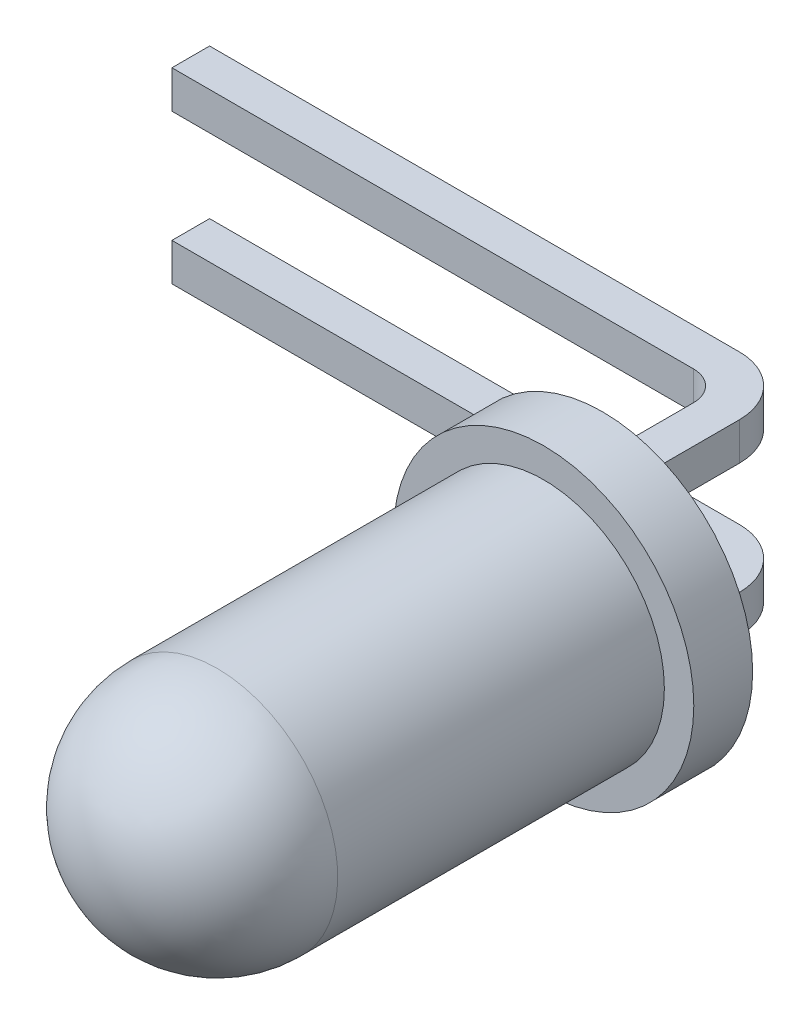
ISO-10303-21;
HEADER;
FILE_DESCRIPTION(('STEP AP214'),'2;1');
FILE_NAME('part.step','',(''),(''),'','','');
FILE_SCHEMA(('AUTOMOTIVE_DESIGN { 1 0 10303 214 1 1 1 1 }'));
ENDSEC;
DATA;
#1=APPLICATION_CONTEXT('core data for automotive mechanical design processes');
#2=APPLICATION_PROTOCOL_DEFINITION('international standard','automotive_design',2000,#1);
#3=PRODUCT_CONTEXT('',#1,'mechanical');
#4=PRODUCT('Part','Part','',(#3));
#5=PRODUCT_RELATED_PRODUCT_CATEGORY('part','',(#4));
#6=PRODUCT_DEFINITION_FORMATION('','',#4);
#7=PRODUCT_DEFINITION_CONTEXT('part definition',#1,'design');
#8=PRODUCT_DEFINITION('design','',#6,#7);
#9=PRODUCT_DEFINITION_SHAPE('','',#8);
#10=(LENGTH_UNIT() NAMED_UNIT(*) SI_UNIT(.MILLI.,.METRE.));
#11=(NAMED_UNIT(*) PLANE_ANGLE_UNIT() SI_UNIT($,.RADIAN.));
#12=(NAMED_UNIT(*) SI_UNIT($,.STERADIAN.) SOLID_ANGLE_UNIT());
#13=UNCERTAINTY_MEASURE_WITH_UNIT(LENGTH_MEASURE(1.E-05),#10,'distance_accuracy_value','');
#14=(GEOMETRIC_REPRESENTATION_CONTEXT(3) GLOBAL_UNCERTAINTY_ASSIGNED_CONTEXT((#13)) GLOBAL_UNIT_ASSIGNED_CONTEXT((#10,
#11,#12)) REPRESENTATION_CONTEXT('',''));
#15=CARTESIAN_POINT('',(0.,0.,0.));
#16=DIRECTION('',(0.,0.,1.));
#17=DIRECTION('',(1.,0.,0.));
#18=AXIS2_PLACEMENT_3D('',#15,#16,#17);
#19=CARTESIAN_POINT('',(0.,0.,0.));
#20=DIRECTION('',(0.,0.,-1.));
#21=DIRECTION('',(-1.,0.,0.));
#22=AXIS2_PLACEMENT_3D('',#19,#20,#21);
#23=PLANE('',#22);
#24=CARTESIAN_POINT('',(0.,0.,0.));
#25=DIRECTION('',(0.,0.,-1.));
#26=DIRECTION('',(-1.,0.,0.));
#27=AXIS2_PLACEMENT_3D('',#24,#25,#26);
#28=CIRCLE('',#27,2.55);
#29=CARTESIAN_POINT('',(-2.55,0.,0.));
#30=VERTEX_POINT('',#29);
#31=EDGE_CURVE('E256',#30,#30,#28,.T.);
#32=ORIENTED_EDGE('',*,*,#31,.T.);
#33=EDGE_LOOP('',(#32));
#34=FACE_BOUND('',#33,.T.);
#35=DIRECTION('',(1.,0.,0.));
#36=VECTOR('',#35,1.);
#37=CARTESIAN_POINT('',(-0.32,0.95,0.));
#38=LINE('',#37,#36);
#39=CARTESIAN_POINT('',(-0.32,0.95,0.));
#40=VERTEX_POINT('',#39);
#41=CARTESIAN_POINT('',(0.32,0.95,0.));
#42=VERTEX_POINT('',#41);
#43=EDGE_CURVE('E230',#40,#42,#38,.T.);
#44=ORIENTED_EDGE('',*,*,#43,.T.);
#45=DIRECTION('',(0.,-1.,0.));
#46=VECTOR('',#45,1.);
#47=CARTESIAN_POINT('',(0.32,1.59,0.));
#48=LINE('',#47,#46);
#49=CARTESIAN_POINT('',(0.32,1.59,0.));
#50=VERTEX_POINT('',#49);
#51=EDGE_CURVE('E227',#50,#42,#48,.T.);
#52=ORIENTED_EDGE('',*,*,#51,.F.);
#53=DIRECTION('',(-1.,0.,0.));
#54=VECTOR('',#53,1.);
#55=CARTESIAN_POINT('',(0.32,1.59,0.));
#56=LINE('',#55,#54);
#57=CARTESIAN_POINT('',(-0.32,1.59,0.));
#58=VERTEX_POINT('',#57);
#59=EDGE_CURVE('E236',#50,#58,#56,.T.);
#60=ORIENTED_EDGE('',*,*,#59,.T.);
#61=DIRECTION('',(0.,1.,0.));
#62=VECTOR('',#61,1.);
#63=CARTESIAN_POINT('',(-0.32,0.95,0.));
#64=LINE('',#63,#62);
#65=EDGE_CURVE('E233',#40,#58,#64,.T.);
#66=ORIENTED_EDGE('',*,*,#65,.F.);
#67=EDGE_LOOP('',(#44,#52,#60,#66));
#68=FACE_BOUND('',#67,.T.);
#69=DIRECTION('',(1.,0.,0.));
#70=VECTOR('',#69,1.);
#71=CARTESIAN_POINT('',(-0.32,-1.59,0.));
#72=LINE('',#71,#70);
#73=CARTESIAN_POINT('',(-0.32,-1.59,0.));
#74=VERTEX_POINT('',#73);
#75=CARTESIAN_POINT('',(0.320000000000001,-1.59,0.));
#76=VERTEX_POINT('',#75);
#77=EDGE_CURVE('E210',#74,#76,#72,.T.);
#78=ORIENTED_EDGE('',*,*,#77,.T.);
#79=DIRECTION('',(0.,-1.,0.));
#80=VECTOR('',#79,1.);
#81=CARTESIAN_POINT('',(0.320000000000001,-0.95,0.));
#82=LINE('',#81,#80);
#83=CARTESIAN_POINT('',(0.320000000000001,-0.95,0.));
#84=VERTEX_POINT('',#83);
#85=EDGE_CURVE('E201',#84,#76,#82,.T.);
#86=ORIENTED_EDGE('',*,*,#85,.F.);
#87=DIRECTION('',(-1.,0.,0.));
#88=VECTOR('',#87,1.);
#89=CARTESIAN_POINT('',(0.320000000000001,-0.95,0.));
#90=LINE('',#89,#88);
#91=CARTESIAN_POINT('',(-0.32,-0.95,0.));
#92=VERTEX_POINT('',#91);
#93=EDGE_CURVE('E216',#84,#92,#90,.T.);
#94=ORIENTED_EDGE('',*,*,#93,.T.);
#95=DIRECTION('',(0.,1.,0.));
#96=VECTOR('',#95,1.);
#97=CARTESIAN_POINT('',(-0.32,-1.59,0.));
#98=LINE('',#97,#96);
#99=EDGE_CURVE('E213',#74,#92,#98,.T.);
#100=ORIENTED_EDGE('',*,*,#99,.F.);
#101=EDGE_LOOP('',(#78,#86,#94,#100));
#102=FACE_BOUND('',#101,.T.);
#103=ADVANCED_FACE('F37',(#34,#68,#102),#23,.T.);
#104=CARTESIAN_POINT('',(0.,0.,0.));
#105=DIRECTION('',(0.,0.,-1.));
#106=DIRECTION('',(-1.,0.,0.));
#107=AXIS2_PLACEMENT_3D('',#104,#105,#106);
#108=CYLINDRICAL_SURFACE('',#107,2.55);
#109=CARTESIAN_POINT('',(0.,0.,1.));
#110=DIRECTION('',(0.,0.,-1.));
#111=DIRECTION('',(-1.,0.,0.));
#112=AXIS2_PLACEMENT_3D('',#109,#110,#111);
#113=CIRCLE('',#112,2.55);
#114=CARTESIAN_POINT('',(-2.55,0.,1.));
#115=VERTEX_POINT('',#114);
#116=EDGE_CURVE('E253',#115,#115,#113,.T.);
#117=ORIENTED_EDGE('',*,*,#116,.T.);
#118=EDGE_LOOP('',(#117));
#119=FACE_BOUND('',#118,.T.);
#120=ORIENTED_EDGE('',*,*,#31,.F.);
#121=EDGE_LOOP('',(#120));
#122=FACE_BOUND('',#121,.T.);
#123=ADVANCED_FACE('F323',(#119,#122),#108,.T.);
#124=CARTESIAN_POINT('',(0.,2.55,1.));
#125=DIRECTION('',(0.,0.,1.));
#126=DIRECTION('',(1.,0.,0.));
#127=AXIS2_PLACEMENT_3D('',#124,#125,#126);
#128=PLANE('',#127);
#129=CARTESIAN_POINT('',(0.,0.,1.));
#130=DIRECTION('',(0.,0.,-1.));
#131=DIRECTION('',(-1.,0.,0.));
#132=AXIS2_PLACEMENT_3D('',#129,#130,#131);
#133=CIRCLE('',#132,2.05);
#134=CARTESIAN_POINT('',(-2.05,0.,1.));
#135=VERTEX_POINT('',#134);
#136=EDGE_CURVE('E250',#135,#135,#133,.T.);
#137=ORIENTED_EDGE('',*,*,#136,.T.);
#138=EDGE_LOOP('',(#137));
#139=FACE_BOUND('',#138,.T.);
#140=ORIENTED_EDGE('',*,*,#116,.F.);
#141=EDGE_LOOP('',(#140));
#142=FACE_BOUND('',#141,.T.);
#143=ADVANCED_FACE('F329',(#139,#142),#128,.T.);
#144=CARTESIAN_POINT('',(0.,0.,0.));
#145=DIRECTION('',(0.,0.,-1.));
#146=DIRECTION('',(-1.,0.,0.));
#147=AXIS2_PLACEMENT_3D('',#144,#145,#146);
#148=CYLINDRICAL_SURFACE('',#147,2.05);
#149=CARTESIAN_POINT('',(0.,0.,6.55));
#150=DIRECTION('',(0.,0.,-1.));
#151=DIRECTION('',(-1.,0.,0.));
#152=AXIS2_PLACEMENT_3D('',#149,#150,#151);
#153=CIRCLE('',#152,2.05);
#154=CARTESIAN_POINT('',(-2.05,0.,6.55));
#155=VERTEX_POINT('',#154);
#156=EDGE_CURVE('E247',#155,#155,#153,.T.);
#157=ORIENTED_EDGE('',*,*,#156,.T.);
#158=EDGE_LOOP('',(#157));
#159=FACE_BOUND('',#158,.T.);
#160=ORIENTED_EDGE('',*,*,#136,.F.);
#161=EDGE_LOOP('',(#160));
#162=FACE_BOUND('',#161,.T.);
#163=ADVANCED_FACE('F400',(#159,#162),#148,.T.);
#164=CARTESIAN_POINT('',(0.,0.,6.55));
#165=DIRECTION('',(0.,0.,-1.));
#166=DIRECTION('',(0.,1.,0.));
#167=AXIS2_PLACEMENT_3D('',#164,#165,#166);
#168=SPHERICAL_SURFACE('',#167,2.05);
#169=ORIENTED_EDGE('',*,*,#156,.F.);
#170=EDGE_LOOP('',(#169));
#171=FACE_BOUND('',#170,.T.);
#172=ADVANCED_FACE('F397',(#171),#168,.T.);
#173=CARTESIAN_POINT('',(0.32,1.59,-2.683));
#174=DIRECTION('',(-1.,0.,0.));
#175=DIRECTION('',(0.,-1.,0.));
#176=AXIS2_PLACEMENT_3D('',#173,#174,#175);
#177=PLANE('',#176);
#178=DIRECTION('',(0.,0.,1.));
#179=VECTOR('',#178,1.);
#180=CARTESIAN_POINT('',(0.32,0.95,-2.683));
#181=LINE('',#180,#179);
#182=CARTESIAN_POINT('',(0.32,0.95,-2.00299999999999));
#183=VERTEX_POINT('',#182);
#184=EDGE_CURVE('E245',#183,#42,#181,.T.);
#185=ORIENTED_EDGE('',*,*,#184,.F.);
#186=DIRECTION('',(0.,1.,0.));
#187=VECTOR('',#186,1.);
#188=CARTESIAN_POINT('',(0.32,1.59,-2.00299999999999));
#189=LINE('',#188,#187);
#190=CARTESIAN_POINT('',(0.32,1.59,-2.00299999999999));
#191=VERTEX_POINT('',#190);
#192=EDGE_CURVE('E268',#183,#191,#189,.T.);
#193=ORIENTED_EDGE('',*,*,#192,.T.);
#194=DIRECTION('',(0.,0.,1.));
#195=VECTOR('',#194,1.);
#196=CARTESIAN_POINT('',(0.32,1.59,-2.683));
#197=LINE('',#196,#195);
#198=EDGE_CURVE('E239',#191,#50,#197,.T.);
#199=ORIENTED_EDGE('',*,*,#198,.T.);
#200=ORIENTED_EDGE('',*,*,#51,.T.);
#201=EDGE_LOOP('',(#185,#193,#199,#200));
#202=FACE_BOUND('',#201,.T.);
#203=ADVANCED_FACE('F306',(#202),#177,.F.);
#204=CARTESIAN_POINT('',(-0.32,0.95,-2.683));
#205=DIRECTION('',(0.,-1.,0.));
#206=DIRECTION('',(1.,0.,0.));
#207=AXIS2_PLACEMENT_3D('',#204,#205,#206);
#208=PLANE('',#207);
#209=DIRECTION('',(1.,0.,0.));
#210=VECTOR('',#209,1.);
#211=CARTESIAN_POINT('',(-9.68,0.949999999999997,-3.00299999999999));
#212=LINE('',#211,#210);
#213=CARTESIAN_POINT('',(-9.68,0.949999999999997,-3.00299999999999));
#214=VERTEX_POINT('',#213);
#215=CARTESIAN_POINT('',(-0.68,0.949999999999999,-3.00299999999999));
#216=VERTEX_POINT('',#215);
#217=EDGE_CURVE('E182',#214,#216,#212,.T.);
#218=ORIENTED_EDGE('',*,*,#217,.T.);
#219=CARTESIAN_POINT('',(-0.68,0.95,-2.00299999999999));
#220=DIRECTION('',(0.,-1.,0.));
#221=DIRECTION('',(1.,0.,0.));
#222=AXIS2_PLACEMENT_3D('',#219,#220,#221);
#223=CIRCLE('',#222,1.);
#224=EDGE_CURVE('E275',#216,#183,#223,.T.);
#225=ORIENTED_EDGE('',*,*,#224,.T.);
#226=ORIENTED_EDGE('',*,*,#184,.T.);
#227=ORIENTED_EDGE('',*,*,#43,.F.);
#228=DIRECTION('',(0.,0.,1.));
#229=VECTOR('',#228,1.);
#230=CARTESIAN_POINT('',(-0.32,0.95,-2.683));
#231=LINE('',#230,#229);
#232=CARTESIAN_POINT('',(-0.32,0.95,-1.86299999999999));
#233=VERTEX_POINT('',#232);
#234=EDGE_CURVE('E243',#233,#40,#231,.T.);
#235=ORIENTED_EDGE('',*,*,#234,.F.);
#236=CARTESIAN_POINT('',(-0.82,0.95,-1.86299999999999));
#237=DIRECTION('',(0.,-1.,0.));
#238=DIRECTION('',(1.,0.,0.));
#239=AXIS2_PLACEMENT_3D('',#236,#237,#238);
#240=CIRCLE('',#239,0.5);
#241=CARTESIAN_POINT('',(-0.82,0.949999999999999,-2.36299999999999));
#242=VERTEX_POINT('',#241);
#243=EDGE_CURVE('E45',#233,#242,#240,.F.);
#244=ORIENTED_EDGE('',*,*,#243,.T.);
#245=DIRECTION('',(1.,0.,0.));
#246=VECTOR('',#245,1.);
#247=CARTESIAN_POINT('',(-9.68,0.949999999999997,-2.36299999999999));
#248=LINE('',#247,#246);
#249=CARTESIAN_POINT('',(-9.68,0.949999999999997,-2.36299999999999));
#250=VERTEX_POINT('',#249);
#251=EDGE_CURVE('E159',#250,#242,#248,.T.);
#252=ORIENTED_EDGE('',*,*,#251,.F.);
#253=DIRECTION('',(0.,0.,-1.));
#254=VECTOR('',#253,1.);
#255=CARTESIAN_POINT('',(-9.68,0.949999999999997,-2.36299999999999));
#256=LINE('',#255,#254);
#257=EDGE_CURVE('E170',#250,#214,#256,.T.);
#258=ORIENTED_EDGE('',*,*,#257,.T.);
#259=EDGE_LOOP('',(#218,#225,#226,#227,#235,#244,#252,#258));
#260=FACE_BOUND('',#259,.T.);
#261=ADVANCED_FACE('F289',(#260),#208,.T.);
#262=CARTESIAN_POINT('',(-0.32,0.95,-2.683));
#263=DIRECTION('',(1.,0.,0.));
#264=DIRECTION('',(0.,1.,0.));
#265=AXIS2_PLACEMENT_3D('',#262,#263,#264);
#266=PLANE('',#265);
#267=DIRECTION('',(0.,0.,1.));
#268=VECTOR('',#267,1.);
#269=CARTESIAN_POINT('',(-0.32,1.59,-2.683));
#270=LINE('',#269,#268);
#271=CARTESIAN_POINT('',(-0.32,1.59,-1.86299999999999));
#272=VERTEX_POINT('',#271);
#273=EDGE_CURVE('E241',#272,#58,#270,.T.);
#274=ORIENTED_EDGE('',*,*,#273,.F.);
#275=DIRECTION('',(0.,-1.,0.));
#276=VECTOR('',#275,1.);
#277=CARTESIAN_POINT('',(-0.32,0.95,-1.86299999999999));
#278=LINE('',#277,#276);
#279=EDGE_CURVE('E264',#272,#233,#278,.T.);
#280=ORIENTED_EDGE('',*,*,#279,.T.);
#281=ORIENTED_EDGE('',*,*,#234,.T.);
#282=ORIENTED_EDGE('',*,*,#65,.T.);
#283=EDGE_LOOP('',(#274,#280,#281,#282));
#284=FACE_BOUND('',#283,.T.);
#285=ADVANCED_FACE('F297',(#284),#266,.F.);
#286=CARTESIAN_POINT('',(0.32,1.59,-2.683));
#287=DIRECTION('',(0.,1.,0.));
#288=DIRECTION('',(0.,0.,1.));
#289=AXIS2_PLACEMENT_3D('',#286,#287,#288);
#290=PLANE('',#289);
#291=ORIENTED_EDGE('',*,*,#198,.F.);
#292=CARTESIAN_POINT('',(-0.68,1.59,-2.00299999999999));
#293=DIRECTION('',(0.,1.,0.));
#294=DIRECTION('',(0.,0.,1.));
#295=AXIS2_PLACEMENT_3D('',#292,#293,#294);
#296=CIRCLE('',#295,1.);
#297=CARTESIAN_POINT('',(-0.68,1.59,-3.00299999999999));
#298=VERTEX_POINT('',#297);
#299=EDGE_CURVE('E271',#191,#298,#296,.T.);
#300=ORIENTED_EDGE('',*,*,#299,.T.);
#301=DIRECTION('',(1.,0.,0.));
#302=VECTOR('',#301,1.);
#303=CARTESIAN_POINT('',(-9.68,1.59,-3.00299999999999));
#304=LINE('',#303,#302);
#305=CARTESIAN_POINT('',(-9.68,1.59,-3.00299999999999));
#306=VERTEX_POINT('',#305);
#307=EDGE_CURVE('E175',#306,#298,#304,.T.);
#308=ORIENTED_EDGE('',*,*,#307,.F.);
#309=DIRECTION('',(0.,0.,1.));
#310=VECTOR('',#309,1.);
#311=CARTESIAN_POINT('',(-9.68,1.59,-2.36299999999999));
#312=LINE('',#311,#310);
#313=CARTESIAN_POINT('',(-9.68,1.59,-2.36299999999999));
#314=VERTEX_POINT('',#313);
#315=EDGE_CURVE('E167',#306,#314,#312,.T.);
#316=ORIENTED_EDGE('',*,*,#315,.T.);
#317=DIRECTION('',(1.,0.,0.));
#318=VECTOR('',#317,1.);
#319=CARTESIAN_POINT('',(-9.68,1.59,-2.36299999999999));
#320=LINE('',#319,#318);
#321=CARTESIAN_POINT('',(-0.82,1.59,-2.36299999999999));
#322=VERTEX_POINT('',#321);
#323=EDGE_CURVE('E149',#314,#322,#320,.T.);
#324=ORIENTED_EDGE('',*,*,#323,.T.);
#325=CARTESIAN_POINT('',(-0.82,1.59,-1.86299999999999));
#326=DIRECTION('',(0.,1.,0.));
#327=DIRECTION('',(0.,0.,1.));
#328=AXIS2_PLACEMENT_3D('',#325,#326,#327);
#329=CIRCLE('',#328,0.5);
#330=EDGE_CURVE('E12',#322,#272,#329,.F.);
#331=ORIENTED_EDGE('',*,*,#330,.T.);
#332=ORIENTED_EDGE('',*,*,#273,.T.);
#333=ORIENTED_EDGE('',*,*,#59,.F.);
#334=EDGE_LOOP('',(#291,#300,#308,#316,#324,#331,#332,#333));
#335=FACE_BOUND('',#334,.T.);
#336=ADVANCED_FACE('F173',(#335),#290,.T.);
#337=CARTESIAN_POINT('',(0.320000000000001,-0.95,-2.683));
#338=DIRECTION('',(-1.,0.,0.));
#339=DIRECTION('',(0.,-1.,0.));
#340=AXIS2_PLACEMENT_3D('',#337,#338,#339);
#341=PLANE('',#340);
#342=DIRECTION('',(0.,0.,1.));
#343=VECTOR('',#342,1.);
#344=CARTESIAN_POINT('',(0.320000000000001,-1.59,-2.683));
#345=LINE('',#344,#343);
#346=CARTESIAN_POINT('',(0.320000000000001,-1.59,-2.003));
#347=VERTEX_POINT('',#346);
#348=EDGE_CURVE('E225',#347,#76,#345,.T.);
#349=ORIENTED_EDGE('',*,*,#348,.F.);
#350=DIRECTION('',(0.,1.,0.));
#351=VECTOR('',#350,1.);
#352=CARTESIAN_POINT('',(0.320000000000001,-0.95,-2.003));
#353=LINE('',#352,#351);
#354=CARTESIAN_POINT('',(0.320000000000001,-0.95,-2.003));
#355=VERTEX_POINT('',#354);
#356=EDGE_CURVE('E277',#347,#355,#353,.T.);
#357=ORIENTED_EDGE('',*,*,#356,.T.);
#358=DIRECTION('',(0.,0.,1.));
#359=VECTOR('',#358,1.);
#360=CARTESIAN_POINT('',(0.320000000000001,-0.95,-2.683));
#361=LINE('',#360,#359);
#362=EDGE_CURVE('E219',#355,#84,#361,.T.);
#363=ORIENTED_EDGE('',*,*,#362,.T.);
#364=ORIENTED_EDGE('',*,*,#85,.T.);
#365=EDGE_LOOP('',(#349,#357,#363,#364));
#366=FACE_BOUND('',#365,.T.);
#367=ADVANCED_FACE('F352',(#366),#341,.F.);
#368=CARTESIAN_POINT('',(-0.32,-1.59,-2.683));
#369=DIRECTION('',(0.,-1.,0.));
#370=DIRECTION('',(1.,0.,0.));
#371=AXIS2_PLACEMENT_3D('',#368,#369,#370);
#372=PLANE('',#371);
#373=DIRECTION('',(1.,0.,0.));
#374=VECTOR('',#373,1.);
#375=CARTESIAN_POINT('',(-9.68,-1.59,-3.003));
#376=LINE('',#375,#374);
#377=CARTESIAN_POINT('',(-9.68,-1.59,-3.003));
#378=VERTEX_POINT('',#377);
#379=CARTESIAN_POINT('',(-0.679999999999998,-1.59,-3.003));
#380=VERTEX_POINT('',#379);
#381=EDGE_CURVE('E204',#378,#380,#376,.T.);
#382=ORIENTED_EDGE('',*,*,#381,.T.);
#383=CARTESIAN_POINT('',(-0.679999999999999,-1.59,-2.003));
#384=DIRECTION('',(0.,-1.,0.));
#385=DIRECTION('',(1.,0.,0.));
#386=AXIS2_PLACEMENT_3D('',#383,#384,#385);
#387=CIRCLE('',#386,1.);
#388=EDGE_CURVE('E282',#380,#347,#387,.T.);
#389=ORIENTED_EDGE('',*,*,#388,.T.);
#390=ORIENTED_EDGE('',*,*,#348,.T.);
#391=ORIENTED_EDGE('',*,*,#77,.F.);
#392=DIRECTION('',(0.,0.,1.));
#393=VECTOR('',#392,1.);
#394=CARTESIAN_POINT('',(-0.32,-1.59,-2.683));
#395=LINE('',#394,#393);
#396=CARTESIAN_POINT('',(-0.32,-1.59,-1.863));
#397=VERTEX_POINT('',#396);
#398=EDGE_CURVE('E223',#397,#74,#395,.T.);
#399=ORIENTED_EDGE('',*,*,#398,.F.);
#400=CARTESIAN_POINT('',(-0.82,-1.59,-1.863));
#401=DIRECTION('',(0.,-1.,0.));
#402=DIRECTION('',(1.,0.,0.));
#403=AXIS2_PLACEMENT_3D('',#400,#401,#402);
#404=CIRCLE('',#403,0.5);
#405=CARTESIAN_POINT('',(-0.82,-1.59,-2.363));
#406=VERTEX_POINT('',#405);
#407=EDGE_CURVE('E284',#397,#406,#404,.F.);
#408=ORIENTED_EDGE('',*,*,#407,.T.);
#409=DIRECTION('',(1.,0.,0.));
#410=VECTOR('',#409,1.);
#411=CARTESIAN_POINT('',(-9.68,-1.59,-2.363));
#412=LINE('',#411,#410);
#413=CARTESIAN_POINT('',(-9.68,-1.59,-2.363));
#414=VERTEX_POINT('',#413);
#415=EDGE_CURVE('E197',#414,#406,#412,.T.);
#416=ORIENTED_EDGE('',*,*,#415,.F.);
#417=DIRECTION('',(0.,0.,-1.));
#418=VECTOR('',#417,1.);
#419=CARTESIAN_POINT('',(-9.68,-1.59,-2.363));
#420=LINE('',#419,#418);
#421=EDGE_CURVE('E188',#414,#378,#420,.T.);
#422=ORIENTED_EDGE('',*,*,#421,.T.);
#423=EDGE_LOOP('',(#382,#389,#390,#391,#399,#408,#416,#422));
#424=FACE_BOUND('',#423,.T.);
#425=ADVANCED_FACE('F349',(#424),#372,.T.);
#426=CARTESIAN_POINT('',(-0.32,-1.59,-2.683));
#427=DIRECTION('',(1.,0.,0.));
#428=DIRECTION('',(0.,0.,-1.));
#429=AXIS2_PLACEMENT_3D('',#426,#427,#428);
#430=PLANE('',#429);
#431=DIRECTION('',(0.,0.,1.));
#432=VECTOR('',#431,1.);
#433=CARTESIAN_POINT('',(-0.32,-0.95,-2.683));
#434=LINE('',#433,#432);
#435=CARTESIAN_POINT('',(-0.32,-0.95,-1.863));
#436=VERTEX_POINT('',#435);
#437=EDGE_CURVE('E221',#436,#92,#434,.T.);
#438=ORIENTED_EDGE('',*,*,#437,.F.);
#439=DIRECTION('',(0.,-1.,0.));
#440=VECTOR('',#439,1.);
#441=CARTESIAN_POINT('',(-0.32,-1.59,-1.863));
#442=LINE('',#441,#440);
#443=EDGE_CURVE('E259',#436,#397,#442,.T.);
#444=ORIENTED_EDGE('',*,*,#443,.T.);
#445=ORIENTED_EDGE('',*,*,#398,.T.);
#446=ORIENTED_EDGE('',*,*,#99,.T.);
#447=EDGE_LOOP('',(#438,#444,#445,#446));
#448=FACE_BOUND('',#447,.T.);
#449=ADVANCED_FACE('F361',(#448),#430,.F.);
#450=CARTESIAN_POINT('',(0.320000000000001,-0.95,-2.683));
#451=DIRECTION('',(0.,1.,0.));
#452=DIRECTION('',(-1.,0.,0.));
#453=AXIS2_PLACEMENT_3D('',#450,#451,#452);
#454=PLANE('',#453);
#455=ORIENTED_EDGE('',*,*,#362,.F.);
#456=CARTESIAN_POINT('',(-0.679999999999999,-0.95,-2.003));
#457=DIRECTION('',(0.,1.,0.));
#458=DIRECTION('',(-1.,0.,0.));
#459=AXIS2_PLACEMENT_3D('',#456,#457,#458);
#460=CIRCLE('',#459,1.);
#461=CARTESIAN_POINT('',(-0.68,-0.95,-3.003));
#462=VERTEX_POINT('',#461);
#463=EDGE_CURVE('E60',#355,#462,#460,.T.);
#464=ORIENTED_EDGE('',*,*,#463,.T.);
#465=DIRECTION('',(1.,0.,0.));
#466=VECTOR('',#465,1.);
#467=CARTESIAN_POINT('',(-9.68,-0.950000000000002,-3.003));
#468=LINE('',#467,#466);
#469=CARTESIAN_POINT('',(-9.68,-0.950000000000002,-3.003));
#470=VERTEX_POINT('',#469);
#471=EDGE_CURVE('E202',#470,#462,#468,.T.);
#472=ORIENTED_EDGE('',*,*,#471,.F.);
#473=DIRECTION('',(0.,0.,1.));
#474=VECTOR('',#473,1.);
#475=CARTESIAN_POINT('',(-9.68,-0.950000000000003,-2.363));
#476=LINE('',#475,#474);
#477=CARTESIAN_POINT('',(-9.68,-0.950000000000003,-2.363));
#478=VERTEX_POINT('',#477);
#479=EDGE_CURVE('E194',#470,#478,#476,.T.);
#480=ORIENTED_EDGE('',*,*,#479,.T.);
#481=DIRECTION('',(1.,0.,0.));
#482=VECTOR('',#481,1.);
#483=CARTESIAN_POINT('',(-9.68,-0.950000000000003,-2.363));
#484=LINE('',#483,#482);
#485=CARTESIAN_POINT('',(-0.82,-0.95,-2.363));
#486=VERTEX_POINT('',#485);
#487=EDGE_CURVE('E198',#478,#486,#484,.T.);
#488=ORIENTED_EDGE('',*,*,#487,.T.);
#489=CARTESIAN_POINT('',(-0.82,-0.95,-1.863));
#490=DIRECTION('',(0.,1.,0.));
#491=DIRECTION('',(-1.,0.,0.));
#492=AXIS2_PLACEMENT_3D('',#489,#490,#491);
#493=CIRCLE('',#492,0.5);
#494=EDGE_CURVE('E286',#486,#436,#493,.F.);
#495=ORIENTED_EDGE('',*,*,#494,.T.);
#496=ORIENTED_EDGE('',*,*,#437,.T.);
#497=ORIENTED_EDGE('',*,*,#93,.F.);
#498=EDGE_LOOP('',(#455,#464,#472,#480,#488,#495,#496,#497));
#499=FACE_BOUND('',#498,.T.);
#500=ADVANCED_FACE('F356',(#499),#454,.T.);
#501=CARTESIAN_POINT('',(-9.68,-0.950000000000003,-2.363));
#502=DIRECTION('',(0.,0.,1.));
#503=DIRECTION('',(1.,0.,0.));
#504=AXIS2_PLACEMENT_3D('',#501,#502,#503);
#505=PLANE('',#504);
#506=ORIENTED_EDGE('',*,*,#415,.T.);
#507=DIRECTION('',(0.,-1.,0.));
#508=VECTOR('',#507,1.);
#509=CARTESIAN_POINT('',(-0.82,-0.950000000000003,-2.363));
#510=LINE('',#509,#508);
#511=EDGE_CURVE('E262',#406,#486,#510,.F.);
#512=ORIENTED_EDGE('',*,*,#511,.T.);
#513=ORIENTED_EDGE('',*,*,#487,.F.);
#514=DIRECTION('',(0.,-1.,0.));
#515=VECTOR('',#514,1.);
#516=CARTESIAN_POINT('',(-9.68,-0.950000000000003,-2.363));
#517=LINE('',#516,#515);
#518=EDGE_CURVE('E181',#478,#414,#517,.T.);
#519=ORIENTED_EDGE('',*,*,#518,.T.);
#520=EDGE_LOOP('',(#506,#512,#513,#519));
#521=FACE_BOUND('',#520,.T.);
#522=ADVANCED_FACE('F366',(#521),#505,.T.);
#523=CARTESIAN_POINT('',(-9.68,-0.950000000000002,-3.003));
#524=DIRECTION('',(0.,0.,-1.));
#525=DIRECTION('',(-1.,0.,0.));
#526=AXIS2_PLACEMENT_3D('',#523,#524,#525);
#527=PLANE('',#526);
#528=ORIENTED_EDGE('',*,*,#471,.T.);
#529=DIRECTION('',(0.,1.,0.));
#530=VECTOR('',#529,1.);
#531=CARTESIAN_POINT('',(-0.679999999999999,-1.59,-3.003));
#532=LINE('',#531,#530);
#533=EDGE_CURVE('E52',#462,#380,#532,.F.);
#534=ORIENTED_EDGE('',*,*,#533,.T.);
#535=ORIENTED_EDGE('',*,*,#381,.F.);
#536=DIRECTION('',(0.,1.,0.));
#537=VECTOR('',#536,1.);
#538=CARTESIAN_POINT('',(-9.68,-0.950000000000002,-3.003));
#539=LINE('',#538,#537);
#540=EDGE_CURVE('E191',#378,#470,#539,.T.);
#541=ORIENTED_EDGE('',*,*,#540,.T.);
#542=EDGE_LOOP('',(#528,#534,#535,#541));
#543=FACE_BOUND('',#542,.T.);
#544=ADVANCED_FACE('F371',(#543),#527,.T.);
#545=CARTESIAN_POINT('',(-9.68,0.,0.));
#546=DIRECTION('',(1.,0.,0.));
#547=DIRECTION('',(0.,1.,0.));
#548=AXIS2_PLACEMENT_3D('',#545,#546,#547);
#549=PLANE('',#548);
#550=ORIENTED_EDGE('',*,*,#518,.F.);
#551=ORIENTED_EDGE('',*,*,#479,.F.);
#552=ORIENTED_EDGE('',*,*,#540,.F.);
#553=ORIENTED_EDGE('',*,*,#421,.F.);
#554=EDGE_LOOP('',(#550,#551,#552,#553));
#555=FACE_BOUND('',#554,.T.);
#556=ADVANCED_FACE('F320',(#555),#549,.F.);
#557=CARTESIAN_POINT('',(-9.68,1.59,-2.36299999999999));
#558=DIRECTION('',(0.,0.,1.));
#559=DIRECTION('',(1.,0.,0.));
#560=AXIS2_PLACEMENT_3D('',#557,#558,#559);
#561=PLANE('',#560);
#562=ORIENTED_EDGE('',*,*,#251,.T.);
#563=DIRECTION('',(0.,-1.,0.));
#564=VECTOR('',#563,1.);
#565=CARTESIAN_POINT('',(-0.82,1.59,-2.36299999999999));
#566=LINE('',#565,#564);
#567=EDGE_CURVE('E155',#242,#322,#566,.F.);
#568=ORIENTED_EDGE('',*,*,#567,.T.);
#569=ORIENTED_EDGE('',*,*,#323,.F.);
#570=DIRECTION('',(0.,-1.,0.));
#571=VECTOR('',#570,1.);
#572=CARTESIAN_POINT('',(-9.68,1.59,-2.36299999999999));
#573=LINE('',#572,#571);
#574=EDGE_CURVE('E153',#314,#250,#573,.T.);
#575=ORIENTED_EDGE('',*,*,#574,.T.);
#576=EDGE_LOOP('',(#562,#568,#569,#575));
#577=FACE_BOUND('',#576,.T.);
#578=ADVANCED_FACE('F152',(#577),#561,.T.);
#579=CARTESIAN_POINT('',(-9.68,1.59,-3.00299999999999));
#580=DIRECTION('',(0.,0.,-1.));
#581=DIRECTION('',(-1.,0.,0.));
#582=AXIS2_PLACEMENT_3D('',#579,#580,#581);
#583=PLANE('',#582);
#584=ORIENTED_EDGE('',*,*,#307,.T.);
#585=DIRECTION('',(0.,1.,0.));
#586=VECTOR('',#585,1.);
#587=CARTESIAN_POINT('',(-0.68,0.949999999999999,-3.00299999999999));
#588=LINE('',#587,#586);
#589=EDGE_CURVE('E273',#298,#216,#588,.F.);
#590=ORIENTED_EDGE('',*,*,#589,.T.);
#591=ORIENTED_EDGE('',*,*,#217,.F.);
#592=DIRECTION('',(0.,1.,0.));
#593=VECTOR('',#592,1.);
#594=CARTESIAN_POINT('',(-9.68,1.59,-3.00299999999999));
#595=LINE('',#594,#593);
#596=EDGE_CURVE('E160',#214,#306,#595,.T.);
#597=ORIENTED_EDGE('',*,*,#596,.T.);
#598=EDGE_LOOP('',(#584,#590,#591,#597));
#599=FACE_BOUND('',#598,.T.);
#600=ADVANCED_FACE('F311',(#599),#583,.T.);
#601=CARTESIAN_POINT('',(-9.68,0.,0.));
#602=DIRECTION('',(-1.,0.,0.));
#603=DIRECTION('',(0.,-1.,0.));
#604=AXIS2_PLACEMENT_3D('',#601,#602,#603);
#605=PLANE('',#604);
#606=ORIENTED_EDGE('',*,*,#315,.F.);
#607=ORIENTED_EDGE('',*,*,#596,.F.);
#608=ORIENTED_EDGE('',*,*,#257,.F.);
#609=ORIENTED_EDGE('',*,*,#574,.F.);
#610=EDGE_LOOP('',(#606,#607,#608,#609));
#611=FACE_BOUND('',#610,.T.);
#612=ADVANCED_FACE('F165',(#611),#605,.T.);
#613=CARTESIAN_POINT('',(-0.82,-1.59,-1.863));
#614=DIRECTION('',(0.,-1.,0.));
#615=DIRECTION('',(0.,0.,-1.));
#616=AXIS2_PLACEMENT_3D('',#613,#614,#615);
#617=CYLINDRICAL_SURFACE('',#616,0.5);
#618=ORIENTED_EDGE('',*,*,#494,.F.);
#619=ORIENTED_EDGE('',*,*,#511,.F.);
#620=ORIENTED_EDGE('',*,*,#407,.F.);
#621=ORIENTED_EDGE('',*,*,#443,.F.);
#622=EDGE_LOOP('',(#618,#619,#620,#621));
#623=FACE_BOUND('',#622,.T.);
#624=ADVANCED_FACE('F318',(#623),#617,.F.);
#625=CARTESIAN_POINT('',(-0.82,0.95,-1.86299999999999));
#626=DIRECTION('',(0.,-1.,0.));
#627=DIRECTION('',(1.,0.,0.));
#628=AXIS2_PLACEMENT_3D('',#625,#626,#627);
#629=CYLINDRICAL_SURFACE('',#628,0.5);
#630=ORIENTED_EDGE('',*,*,#330,.F.);
#631=ORIENTED_EDGE('',*,*,#567,.F.);
#632=ORIENTED_EDGE('',*,*,#243,.F.);
#633=ORIENTED_EDGE('',*,*,#279,.F.);
#634=EDGE_LOOP('',(#630,#631,#632,#633));
#635=FACE_BOUND('',#634,.T.);
#636=ADVANCED_FACE('F293',(#635),#629,.F.);
#637=CARTESIAN_POINT('',(-0.68,1.59,-2.00299999999999));
#638=DIRECTION('',(0.,-1.,0.));
#639=DIRECTION('',(1.,0.,0.));
#640=AXIS2_PLACEMENT_3D('',#637,#638,#639);
#641=CYLINDRICAL_SURFACE('',#640,1.);
#642=ORIENTED_EDGE('',*,*,#224,.F.);
#643=ORIENTED_EDGE('',*,*,#589,.F.);
#644=ORIENTED_EDGE('',*,*,#299,.F.);
#645=ORIENTED_EDGE('',*,*,#192,.F.);
#646=EDGE_LOOP('',(#642,#643,#644,#645));
#647=FACE_BOUND('',#646,.T.);
#648=ADVANCED_FACE('F308',(#647),#641,.T.);
#649=CARTESIAN_POINT('',(-0.679999999999999,-0.95,-2.003));
#650=DIRECTION('',(0.,-1.,0.));
#651=DIRECTION('',(1.,0.,0.));
#652=AXIS2_PLACEMENT_3D('',#649,#650,#651);
#653=CYLINDRICAL_SURFACE('',#652,1.);
#654=ORIENTED_EDGE('',*,*,#388,.F.);
#655=ORIENTED_EDGE('',*,*,#533,.F.);
#656=ORIENTED_EDGE('',*,*,#463,.F.);
#657=ORIENTED_EDGE('',*,*,#356,.F.);
#658=EDGE_LOOP('',(#654,#655,#656,#657));
#659=FACE_BOUND('',#658,.T.);
#660=ADVANCED_FACE('F39',(#659),#653,.T.);
#661=CLOSED_SHELL('',(#103,#123,#143,#163,#172,#203,#261,#285,#336,#367,#425,#449,#500,#522,
#544,#556,#578,#600,#612,#624,#636,#648,#660));
#662=MANIFOLD_SOLID_BREP('B2',#661);
#663=ADVANCED_BREP_SHAPE_REPRESENTATION('',(#18,#662),#14);
#664=SHAPE_DEFINITION_REPRESENTATION(#9,#663);
ENDSEC;
END-ISO-10303-21;
